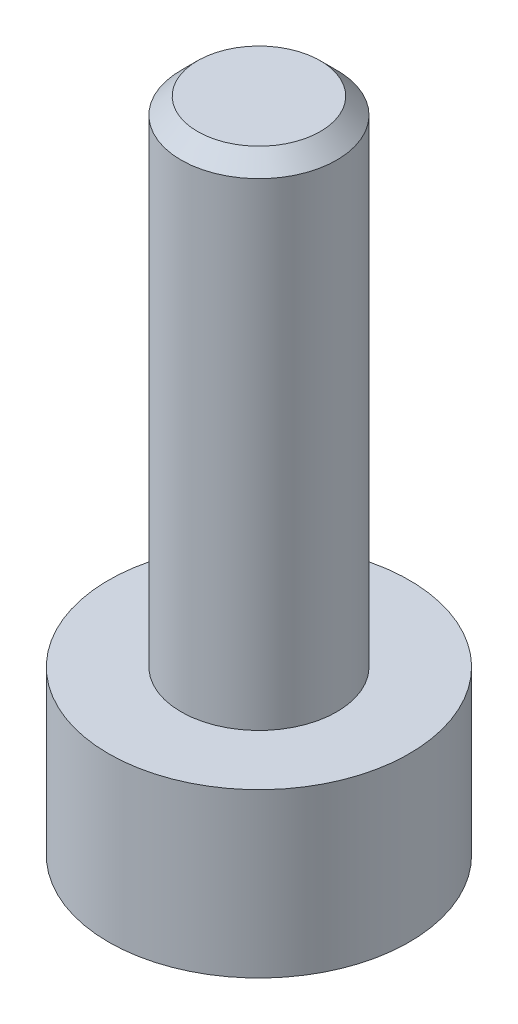
ISO-10303-21;
HEADER;
FILE_DESCRIPTION(('STEP AP214'),'2;1');
FILE_NAME('part.step','',(''),(''),'','','');
FILE_SCHEMA(('AUTOMOTIVE_DESIGN { 1 0 10303 214 1 1 1 1 }'));
ENDSEC;
DATA;
#1=APPLICATION_CONTEXT('core data for automotive mechanical design processes');
#2=APPLICATION_PROTOCOL_DEFINITION('international standard','automotive_design',2000,#1);
#3=PRODUCT_CONTEXT('',#1,'mechanical');
#4=PRODUCT('Part','Part','',(#3));
#5=PRODUCT_RELATED_PRODUCT_CATEGORY('part','',(#4));
#6=PRODUCT_DEFINITION_FORMATION('','',#4);
#7=PRODUCT_DEFINITION_CONTEXT('part definition',#1,'design');
#8=PRODUCT_DEFINITION('design','',#6,#7);
#9=PRODUCT_DEFINITION_SHAPE('','',#8);
#10=(LENGTH_UNIT() NAMED_UNIT(*) SI_UNIT(.MILLI.,.METRE.));
#11=(NAMED_UNIT(*) PLANE_ANGLE_UNIT() SI_UNIT($,.RADIAN.));
#12=(NAMED_UNIT(*) SI_UNIT($,.STERADIAN.) SOLID_ANGLE_UNIT());
#13=UNCERTAINTY_MEASURE_WITH_UNIT(LENGTH_MEASURE(1.E-05),#10,'distance_accuracy_value','');
#14=(GEOMETRIC_REPRESENTATION_CONTEXT(3) GLOBAL_UNCERTAINTY_ASSIGNED_CONTEXT((#13)) GLOBAL_UNIT_ASSIGNED_CONTEXT((#10,
#11,#12)) REPRESENTATION_CONTEXT('',''));
#15=CARTESIAN_POINT('',(0.,0.,0.));
#16=DIRECTION('',(0.,0.,1.));
#17=DIRECTION('',(1.,0.,0.));
#18=AXIS2_PLACEMENT_3D('',#15,#16,#17);
#19=CARTESIAN_POINT('',(0.,1.98,0.));
#20=DIRECTION('',(0.,-1.,0.));
#21=DIRECTION('',(0.,0.,-1.));
#22=AXIS2_PLACEMENT_3D('',#19,#20,#21);
#23=CYLINDRICAL_SURFACE('',#22,1.825);
#24=CARTESIAN_POINT('',(0.,1.98,0.));
#25=DIRECTION('',(0.,1.,0.));
#26=DIRECTION('',(0.,0.,1.));
#27=AXIS2_PLACEMENT_3D('',#24,#25,#26);
#28=CIRCLE('',#27,1.825);
#29=CARTESIAN_POINT('',(0.,1.98,1.825));
#30=VERTEX_POINT('',#29);
#31=EDGE_CURVE('E177',#30,#30,#28,.T.);
#32=ORIENTED_EDGE('',*,*,#31,.F.);
#33=EDGE_LOOP('',(#32));
#34=FACE_BOUND('',#33,.T.);
#35=CARTESIAN_POINT('',(0.,0.,0.));
#36=DIRECTION('',(0.,1.,0.));
#37=DIRECTION('',(0.,0.,1.));
#38=AXIS2_PLACEMENT_3D('',#35,#36,#37);
#39=CIRCLE('',#38,1.825);
#40=CARTESIAN_POINT('',(0.,0.,1.825));
#41=VERTEX_POINT('',#40);
#42=EDGE_CURVE('E163',#41,#41,#39,.T.);
#43=ORIENTED_EDGE('',*,*,#42,.T.);
#44=EDGE_LOOP('',(#43));
#45=FACE_BOUND('',#44,.T.);
#46=ADVANCED_FACE('F47',(#34,#45),#23,.T.);
#47=CARTESIAN_POINT('',(0.,1.98,0.));
#48=DIRECTION('',(0.,1.,0.));
#49=DIRECTION('',(0.,0.,1.));
#50=AXIS2_PLACEMENT_3D('',#47,#48,#49);
#51=PLANE('',#50);
#52=CARTESIAN_POINT('',(0.,1.98,0.));
#53=DIRECTION('',(0.,1.,0.));
#54=DIRECTION('',(0.,0.,1.));
#55=AXIS2_PLACEMENT_3D('',#52,#53,#54);
#56=CIRCLE('',#55,0.945);
#57=CARTESIAN_POINT('',(0.,1.98,0.945));
#58=VERTEX_POINT('',#57);
#59=EDGE_CURVE('E173',#58,#58,#56,.T.);
#60=ORIENTED_EDGE('',*,*,#59,.F.);
#61=EDGE_LOOP('',(#60));
#62=FACE_BOUND('',#61,.T.);
#63=ORIENTED_EDGE('',*,*,#31,.T.);
#64=EDGE_LOOP('',(#63));
#65=FACE_BOUND('',#64,.T.);
#66=ADVANCED_FACE('F199',(#62,#65),#51,.T.);
#67=CARTESIAN_POINT('',(0.,0.,0.));
#68=DIRECTION('',(0.,1.,0.));
#69=DIRECTION('',(0.,0.,1.));
#70=AXIS2_PLACEMENT_3D('',#67,#68,#69);
#71=PLANE('',#70);
#72=DIRECTION('',(0.5,0.,0.866025403784439));
#73=VECTOR('',#72,1.);
#74=CARTESIAN_POINT('',(0.458993464005752,0.,-0.795));
#75=LINE('',#74,#73);
#76=CARTESIAN_POINT('',(0.458993464005752,0.,-0.795));
#77=VERTEX_POINT('',#76);
#78=CARTESIAN_POINT('',(0.917986928011505,0.,0.));
#79=VERTEX_POINT('',#78);
#80=EDGE_CURVE('E144',#77,#79,#75,.T.);
#81=ORIENTED_EDGE('',*,*,#80,.F.);
#82=DIRECTION('',(1.,0.,0.));
#83=VECTOR('',#82,1.);
#84=CARTESIAN_POINT('',(-0.458993464005752,0.,-0.795));
#85=LINE('',#84,#83);
#86=CARTESIAN_POINT('',(-0.458993464005752,0.,-0.795));
#87=VERTEX_POINT('',#86);
#88=EDGE_CURVE('E64',#87,#77,#85,.T.);
#89=ORIENTED_EDGE('',*,*,#88,.F.);
#90=DIRECTION('',(0.5,0.,-0.866025403784439));
#91=VECTOR('',#90,1.);
#92=CARTESIAN_POINT('',(-0.917986928011505,0.,0.));
#93=LINE('',#92,#91);
#94=CARTESIAN_POINT('',(-0.917986928011505,0.,0.));
#95=VERTEX_POINT('',#94);
#96=EDGE_CURVE('E157',#95,#87,#93,.T.);
#97=ORIENTED_EDGE('',*,*,#96,.F.);
#98=DIRECTION('',(-0.5,0.,-0.866025403784439));
#99=VECTOR('',#98,1.);
#100=CARTESIAN_POINT('',(-0.458993464005753,0.,0.795));
#101=LINE('',#100,#99);
#102=CARTESIAN_POINT('',(-0.458993464005753,0.,0.795));
#103=VERTEX_POINT('',#102);
#104=EDGE_CURVE('E154',#103,#95,#101,.T.);
#105=ORIENTED_EDGE('',*,*,#104,.F.);
#106=DIRECTION('',(-1.,0.,0.));
#107=VECTOR('',#106,1.);
#108=CARTESIAN_POINT('',(0.458993464005752,0.,0.795));
#109=LINE('',#108,#107);
#110=CARTESIAN_POINT('',(0.458993464005752,0.,0.795));
#111=VERTEX_POINT('',#110);
#112=EDGE_CURVE('E112',#111,#103,#109,.T.);
#113=ORIENTED_EDGE('',*,*,#112,.F.);
#114=DIRECTION('',(-0.5,0.,0.866025403784438));
#115=VECTOR('',#114,1.);
#116=CARTESIAN_POINT('',(0.917986928011505,0.,0.));
#117=LINE('',#116,#115);
#118=EDGE_CURVE('E148',#79,#111,#117,.T.);
#119=ORIENTED_EDGE('',*,*,#118,.F.);
#120=EDGE_LOOP('',(#81,#89,#97,#105,#113,#119));
#121=FACE_BOUND('',#120,.T.);
#122=ORIENTED_EDGE('',*,*,#42,.F.);
#123=EDGE_LOOP('',(#122));
#124=FACE_BOUND('',#123,.T.);
#125=ADVANCED_FACE('F204',(#121,#124),#71,.F.);
#126=CARTESIAN_POINT('',(0.,7.98,0.));
#127=DIRECTION('',(0.,-1.,0.));
#128=DIRECTION('',(0.,0.,-1.));
#129=AXIS2_PLACEMENT_3D('',#126,#127,#128);
#130=CYLINDRICAL_SURFACE('',#129,0.945);
#131=CARTESIAN_POINT('',(0.,7.78,0.));
#132=DIRECTION('',(0.,1.,0.));
#133=DIRECTION('',(0.,0.,1.));
#134=AXIS2_PLACEMENT_3D('',#131,#132,#133);
#135=CIRCLE('',#134,0.945);
#136=CARTESIAN_POINT('',(0.,7.78,0.945));
#137=VERTEX_POINT('',#136);
#138=EDGE_CURVE('E11',#137,#137,#135,.F.);
#139=ORIENTED_EDGE('',*,*,#138,.T.);
#140=EDGE_LOOP('',(#139));
#141=FACE_BOUND('',#140,.T.);
#142=ORIENTED_EDGE('',*,*,#59,.T.);
#143=EDGE_LOOP('',(#142));
#144=FACE_BOUND('',#143,.T.);
#145=ADVANCED_FACE('F211',(#141,#144),#130,.T.);
#146=CARTESIAN_POINT('',(0.,7.98,0.));
#147=DIRECTION('',(0.,1.,0.));
#148=DIRECTION('',(0.,0.,1.));
#149=AXIS2_PLACEMENT_3D('',#146,#147,#148);
#150=PLANE('',#149);
#151=CARTESIAN_POINT('',(0.,7.98,0.));
#152=DIRECTION('',(0.,1.,0.));
#153=DIRECTION('',(0.,0.,1.));
#154=AXIS2_PLACEMENT_3D('',#151,#152,#153);
#155=CIRCLE('',#154,0.745000000000002);
#156=CARTESIAN_POINT('',(0.,7.98,0.745000000000002));
#157=VERTEX_POINT('',#156);
#158=EDGE_CURVE('E57',#157,#157,#155,.T.);
#159=ORIENTED_EDGE('',*,*,#158,.T.);
#160=EDGE_LOOP('',(#159));
#161=FACE_BOUND('',#160,.T.);
#162=ADVANCED_FACE('F187',(#161),#150,.T.);
#163=CARTESIAN_POINT('',(-0.458993464005752,1.,-0.795));
#164=DIRECTION('',(0.,0.,-1.));
#165=DIRECTION('',(-1.,0.,0.));
#166=AXIS2_PLACEMENT_3D('',#163,#164,#165);
#167=PLANE('',#166);
#168=ORIENTED_EDGE('',*,*,#88,.T.);
#169=DIRECTION('',(0.,-1.,0.));
#170=VECTOR('',#169,1.);
#171=CARTESIAN_POINT('',(0.458993464005752,1.,-0.795));
#172=LINE('',#171,#170);
#173=CARTESIAN_POINT('',(0.458993464005752,1.,-0.795));
#174=VERTEX_POINT('',#173);
#175=EDGE_CURVE('E94',#174,#77,#172,.T.);
#176=ORIENTED_EDGE('',*,*,#175,.F.);
#177=DIRECTION('',(1.,0.,0.));
#178=VECTOR('',#177,1.);
#179=CARTESIAN_POINT('',(-0.458993464005752,1.,-0.795));
#180=LINE('',#179,#178);
#181=CARTESIAN_POINT('',(-0.458993464005752,1.,-0.795));
#182=VERTEX_POINT('',#181);
#183=EDGE_CURVE('E160',#182,#174,#180,.T.);
#184=ORIENTED_EDGE('',*,*,#183,.F.);
#185=DIRECTION('',(0.,-1.,0.));
#186=VECTOR('',#185,1.);
#187=CARTESIAN_POINT('',(-0.458993464005752,1.,-0.795));
#188=LINE('',#187,#186);
#189=EDGE_CURVE('E72',#182,#87,#188,.T.);
#190=ORIENTED_EDGE('',*,*,#189,.T.);
#191=EDGE_LOOP('',(#168,#176,#184,#190));
#192=FACE_BOUND('',#191,.T.);
#193=ADVANCED_FACE('F218',(#192),#167,.F.);
#194=CARTESIAN_POINT('',(-0.917986928011505,1.,0.));
#195=DIRECTION('',(-0.866025403784439,0.,-0.5));
#196=DIRECTION('',(-0.5,0.,0.866025403784439));
#197=AXIS2_PLACEMENT_3D('',#194,#195,#196);
#198=PLANE('',#197);
#199=ORIENTED_EDGE('',*,*,#96,.T.);
#200=ORIENTED_EDGE('',*,*,#189,.F.);
#201=DIRECTION('',(0.5,0.,-0.866025403784439));
#202=VECTOR('',#201,1.);
#203=CARTESIAN_POINT('',(-0.917986928011505,1.,0.));
#204=LINE('',#203,#202);
#205=CARTESIAN_POINT('',(-0.917986928011505,1.,0.));
#206=VERTEX_POINT('',#205);
#207=EDGE_CURVE('E126',#206,#182,#204,.T.);
#208=ORIENTED_EDGE('',*,*,#207,.F.);
#209=DIRECTION('',(0.,-1.,0.));
#210=VECTOR('',#209,1.);
#211=CARTESIAN_POINT('',(-0.917986928011505,1.,0.));
#212=LINE('',#211,#210);
#213=EDGE_CURVE('E117',#206,#95,#212,.T.);
#214=ORIENTED_EDGE('',*,*,#213,.T.);
#215=EDGE_LOOP('',(#199,#200,#208,#214));
#216=FACE_BOUND('',#215,.T.);
#217=ADVANCED_FACE('F221',(#216),#198,.F.);
#218=CARTESIAN_POINT('',(-0.458993464005753,1.,0.795));
#219=DIRECTION('',(-0.866025403784439,0.,0.5));
#220=DIRECTION('',(0.5,0.,0.866025403784439));
#221=AXIS2_PLACEMENT_3D('',#218,#219,#220);
#222=PLANE('',#221);
#223=ORIENTED_EDGE('',*,*,#104,.T.);
#224=ORIENTED_EDGE('',*,*,#213,.F.);
#225=DIRECTION('',(-0.5,0.,-0.866025403784439));
#226=VECTOR('',#225,1.);
#227=CARTESIAN_POINT('',(-0.458993464005753,1.,0.795));
#228=LINE('',#227,#226);
#229=CARTESIAN_POINT('',(-0.458993464005753,1.,0.795));
#230=VERTEX_POINT('',#229);
#231=EDGE_CURVE('E121',#230,#206,#228,.T.);
#232=ORIENTED_EDGE('',*,*,#231,.F.);
#233=DIRECTION('',(0.,-1.,0.));
#234=VECTOR('',#233,1.);
#235=CARTESIAN_POINT('',(-0.458993464005753,1.,0.795));
#236=LINE('',#235,#234);
#237=EDGE_CURVE('E105',#230,#103,#236,.T.);
#238=ORIENTED_EDGE('',*,*,#237,.T.);
#239=EDGE_LOOP('',(#223,#224,#232,#238));
#240=FACE_BOUND('',#239,.T.);
#241=ADVANCED_FACE('F122',(#240),#222,.F.);
#242=CARTESIAN_POINT('',(0.458993464005752,1.,0.795));
#243=DIRECTION('',(0.,0.,1.));
#244=DIRECTION('',(1.,0.,0.));
#245=AXIS2_PLACEMENT_3D('',#242,#243,#244);
#246=PLANE('',#245);
#247=ORIENTED_EDGE('',*,*,#112,.T.);
#248=ORIENTED_EDGE('',*,*,#237,.F.);
#249=DIRECTION('',(-1.,0.,0.));
#250=VECTOR('',#249,1.);
#251=CARTESIAN_POINT('',(0.458993464005752,1.,0.795));
#252=LINE('',#251,#250);
#253=CARTESIAN_POINT('',(0.458993464005752,1.,0.795));
#254=VERTEX_POINT('',#253);
#255=EDGE_CURVE('E109',#254,#230,#252,.T.);
#256=ORIENTED_EDGE('',*,*,#255,.F.);
#257=DIRECTION('',(0.,-1.,0.));
#258=VECTOR('',#257,1.);
#259=CARTESIAN_POINT('',(0.458993464005752,1.,0.795));
#260=LINE('',#259,#258);
#261=EDGE_CURVE('E118',#254,#111,#260,.T.);
#262=ORIENTED_EDGE('',*,*,#261,.T.);
#263=EDGE_LOOP('',(#247,#248,#256,#262));
#264=FACE_BOUND('',#263,.T.);
#265=ADVANCED_FACE('F107',(#264),#246,.F.);
#266=CARTESIAN_POINT('',(0.917986928011505,1.,0.));
#267=DIRECTION('',(0.866025403784438,0.,0.5));
#268=DIRECTION('',(0.5,0.,-0.866025403784439));
#269=AXIS2_PLACEMENT_3D('',#266,#267,#268);
#270=PLANE('',#269);
#271=ORIENTED_EDGE('',*,*,#118,.T.);
#272=ORIENTED_EDGE('',*,*,#261,.F.);
#273=DIRECTION('',(-0.5,0.,0.866025403784438));
#274=VECTOR('',#273,1.);
#275=CARTESIAN_POINT('',(0.917986928011505,1.,0.));
#276=LINE('',#275,#274);
#277=CARTESIAN_POINT('',(0.917986928011505,1.,0.));
#278=VERTEX_POINT('',#277);
#279=EDGE_CURVE('E132',#278,#254,#276,.T.);
#280=ORIENTED_EDGE('',*,*,#279,.F.);
#281=DIRECTION('',(0.,-1.,0.));
#282=VECTOR('',#281,1.);
#283=CARTESIAN_POINT('',(0.917986928011505,1.,0.));
#284=LINE('',#283,#282);
#285=EDGE_CURVE('E168',#278,#79,#284,.T.);
#286=ORIENTED_EDGE('',*,*,#285,.T.);
#287=EDGE_LOOP('',(#271,#272,#280,#286));
#288=FACE_BOUND('',#287,.T.);
#289=ADVANCED_FACE('F224',(#288),#270,.F.);
#290=CARTESIAN_POINT('',(0.458993464005752,1.,-0.795));
#291=DIRECTION('',(0.866025403784439,0.,-0.5));
#292=DIRECTION('',(-0.5,0.,-0.866025403784439));
#293=AXIS2_PLACEMENT_3D('',#290,#291,#292);
#294=PLANE('',#293);
#295=ORIENTED_EDGE('',*,*,#80,.T.);
#296=ORIENTED_EDGE('',*,*,#285,.F.);
#297=DIRECTION('',(0.5,0.,0.866025403784439));
#298=VECTOR('',#297,1.);
#299=CARTESIAN_POINT('',(0.458993464005752,1.,-0.795));
#300=LINE('',#299,#298);
#301=EDGE_CURVE('E136',#174,#278,#300,.T.);
#302=ORIENTED_EDGE('',*,*,#301,.F.);
#303=ORIENTED_EDGE('',*,*,#175,.T.);
#304=EDGE_LOOP('',(#295,#296,#302,#303));
#305=FACE_BOUND('',#304,.T.);
#306=ADVANCED_FACE('F195',(#305),#294,.F.);
#307=CARTESIAN_POINT('',(0.,1.,0.));
#308=DIRECTION('',(0.,-1.,0.));
#309=DIRECTION('',(0.,0.,-1.));
#310=AXIS2_PLACEMENT_3D('',#307,#308,#309);
#311=PLANE('',#310);
#312=ORIENTED_EDGE('',*,*,#183,.T.);
#313=ORIENTED_EDGE('',*,*,#301,.T.);
#314=ORIENTED_EDGE('',*,*,#279,.T.);
#315=ORIENTED_EDGE('',*,*,#255,.T.);
#316=ORIENTED_EDGE('',*,*,#231,.T.);
#317=ORIENTED_EDGE('',*,*,#207,.T.);
#318=EDGE_LOOP('',(#312,#313,#314,#315,#316,#317));
#319=FACE_BOUND('',#318,.T.);
#320=ADVANCED_FACE('F129',(#319),#311,.T.);
#321=CARTESIAN_POINT('',(0.,7.98,0.));
#322=DIRECTION('',(0.,-1.,0.));
#323=DIRECTION('',(0.,0.,-1.));
#324=AXIS2_PLACEMENT_3D('',#321,#322,#323);
#325=CONICAL_SURFACE('',#324,0.745000000000002,0.785398163397443);
#326=ORIENTED_EDGE('',*,*,#138,.F.);
#327=EDGE_LOOP('',(#326));
#328=FACE_BOUND('',#327,.T.);
#329=ORIENTED_EDGE('',*,*,#158,.F.);
#330=EDGE_LOOP('',(#329));
#331=FACE_BOUND('',#330,.T.);
#332=ADVANCED_FACE('F50',(#328,#331),#325,.T.);
#333=CLOSED_SHELL('',(#46,#66,#125,#145,#162,#193,#217,#241,#265,#289,#306,#320,#332));
#334=MANIFOLD_SOLID_BREP('B2',#333);
#335=ADVANCED_BREP_SHAPE_REPRESENTATION('',(#18,#334),#14);
#336=SHAPE_DEFINITION_REPRESENTATION(#9,#335);
ENDSEC;
END-ISO-10303-21;
